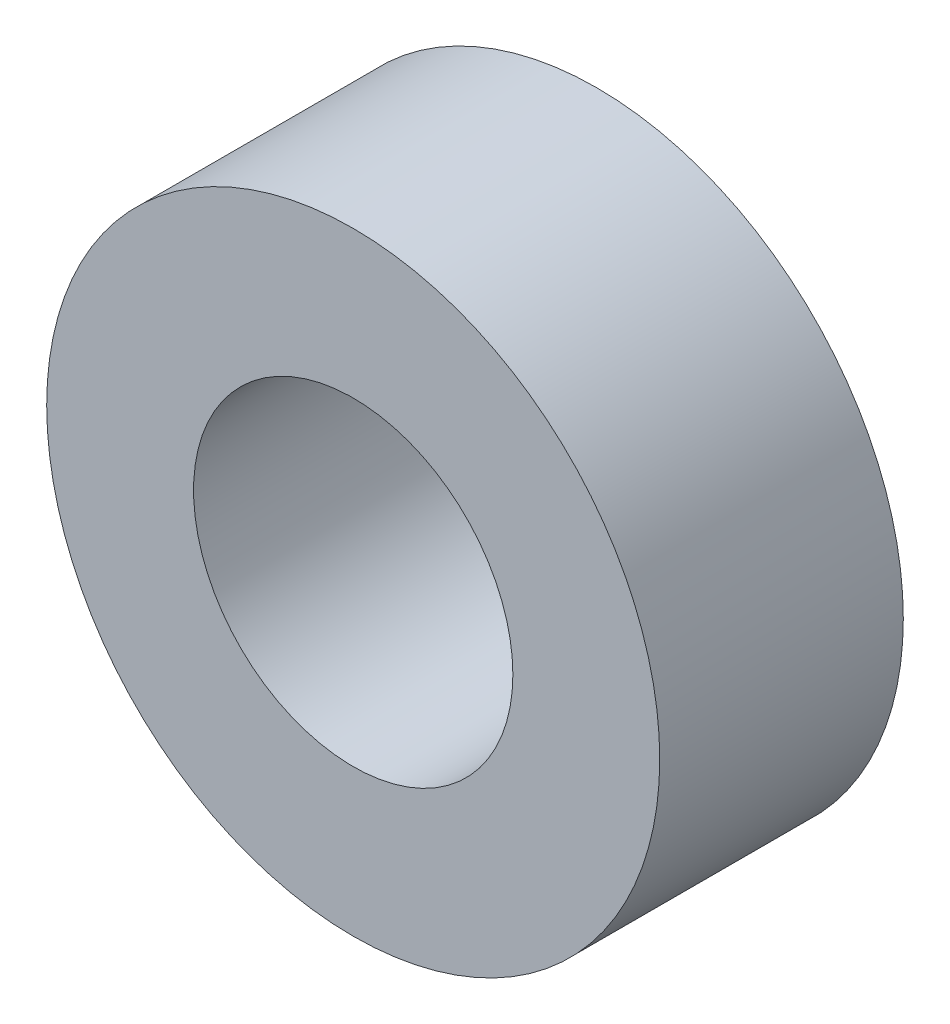
ISO-10303-21;
HEADER;
FILE_DESCRIPTION(('STEP AP214'),'2;1');
FILE_NAME('part.step','',(''),(''),'','','');
FILE_SCHEMA(('AUTOMOTIVE_DESIGN { 1 0 10303 214 1 1 1 1 }'));
ENDSEC;
DATA;
#1=APPLICATION_CONTEXT('core data for automotive mechanical design processes');
#2=APPLICATION_PROTOCOL_DEFINITION('international standard','automotive_design',2000,#1);
#3=PRODUCT_CONTEXT('',#1,'mechanical');
#4=PRODUCT('Part','Part','',(#3));
#5=PRODUCT_RELATED_PRODUCT_CATEGORY('part','',(#4));
#6=PRODUCT_DEFINITION_FORMATION('','',#4);
#7=PRODUCT_DEFINITION_CONTEXT('part definition',#1,'design');
#8=PRODUCT_DEFINITION('design','',#6,#7);
#9=PRODUCT_DEFINITION_SHAPE('','',#8);
#10=(LENGTH_UNIT() NAMED_UNIT(*) SI_UNIT(.MILLI.,.METRE.));
#11=(NAMED_UNIT(*) PLANE_ANGLE_UNIT() SI_UNIT($,.RADIAN.));
#12=(NAMED_UNIT(*) SI_UNIT($,.STERADIAN.) SOLID_ANGLE_UNIT());
#13=UNCERTAINTY_MEASURE_WITH_UNIT(LENGTH_MEASURE(1.E-05),#10,'distance_accuracy_value','');
#14=(GEOMETRIC_REPRESENTATION_CONTEXT(3) GLOBAL_UNCERTAINTY_ASSIGNED_CONTEXT((#13)) GLOBAL_UNIT_ASSIGNED_CONTEXT((#10,
#11,#12)) REPRESENTATION_CONTEXT('',''));
#15=CARTESIAN_POINT('',(0.,0.,0.));
#16=DIRECTION('',(0.,0.,1.));
#17=DIRECTION('',(1.,0.,0.));
#18=AXIS2_PLACEMENT_3D('',#15,#16,#17);
#19=CARTESIAN_POINT('',(0.,0.,1.907));
#20=DIRECTION('',(0.,0.,1.));
#21=DIRECTION('',(1.,0.,0.));
#22=AXIS2_PLACEMENT_3D('',#19,#20,#21);
#23=PLANE('',#22);
#24=CARTESIAN_POINT('',(0.,0.,1.907));
#25=DIRECTION('',(0.,0.,1.));
#26=DIRECTION('',(1.,0.,0.));
#27=AXIS2_PLACEMENT_3D('',#24,#25,#26);
#28=CIRCLE('',#27,2.4);
#29=CARTESIAN_POINT('',(2.4,0.,1.907));
#30=VERTEX_POINT('',#29);
#31=EDGE_CURVE('E10',#30,#30,#28,.T.);
#32=ORIENTED_EDGE('',*,*,#31,.T.);
#33=EDGE_LOOP('',(#32));
#34=FACE_BOUND('',#33,.T.);
#35=CARTESIAN_POINT('',(0.,0.,1.907));
#36=DIRECTION('',(0.,0.,1.));
#37=DIRECTION('',(1.,0.,0.));
#38=AXIS2_PLACEMENT_3D('',#35,#36,#37);
#39=CIRCLE('',#38,1.25);
#40=CARTESIAN_POINT('',(1.25,0.,1.907));
#41=VERTEX_POINT('',#40);
#42=EDGE_CURVE('E50',#41,#41,#39,.T.);
#43=ORIENTED_EDGE('',*,*,#42,.F.);
#44=EDGE_LOOP('',(#43));
#45=FACE_BOUND('',#44,.T.);
#46=ADVANCED_FACE('F37',(#34,#45),#23,.T.);
#47=CARTESIAN_POINT('',(0.,0.,0.));
#48=DIRECTION('',(0.,0.,1.));
#49=DIRECTION('',(1.,0.,0.));
#50=AXIS2_PLACEMENT_3D('',#47,#48,#49);
#51=PLANE('',#50);
#52=CARTESIAN_POINT('',(0.,0.,0.));
#53=DIRECTION('',(0.,0.,1.));
#54=DIRECTION('',(1.,0.,0.));
#55=AXIS2_PLACEMENT_3D('',#52,#53,#54);
#56=CIRCLE('',#55,2.4);
#57=CARTESIAN_POINT('',(2.4,0.,0.));
#58=VERTEX_POINT('',#57);
#59=EDGE_CURVE('E41',#58,#58,#56,.T.);
#60=ORIENTED_EDGE('',*,*,#59,.F.);
#61=EDGE_LOOP('',(#60));
#62=FACE_BOUND('',#61,.T.);
#63=CARTESIAN_POINT('',(0.,0.,0.));
#64=DIRECTION('',(0.,0.,1.));
#65=DIRECTION('',(1.,0.,0.));
#66=AXIS2_PLACEMENT_3D('',#63,#64,#65);
#67=CIRCLE('',#66,1.25);
#68=CARTESIAN_POINT('',(1.25,0.,0.));
#69=VERTEX_POINT('',#68);
#70=EDGE_CURVE('E52',#69,#69,#67,.T.);
#71=ORIENTED_EDGE('',*,*,#70,.T.);
#72=EDGE_LOOP('',(#71));
#73=FACE_BOUND('',#72,.T.);
#74=ADVANCED_FACE('F64',(#62,#73),#51,.F.);
#75=CARTESIAN_POINT('',(0.,0.,1.907));
#76=DIRECTION('',(0.,0.,-1.));
#77=DIRECTION('',(-1.,0.,0.));
#78=AXIS2_PLACEMENT_3D('',#75,#76,#77);
#79=CYLINDRICAL_SURFACE('',#78,2.4);
#80=ORIENTED_EDGE('',*,*,#31,.F.);
#81=EDGE_LOOP('',(#80));
#82=FACE_BOUND('',#81,.T.);
#83=ORIENTED_EDGE('',*,*,#59,.T.);
#84=EDGE_LOOP('',(#83));
#85=FACE_BOUND('',#84,.T.);
#86=ADVANCED_FACE('F39',(#82,#85),#79,.T.);
#87=CARTESIAN_POINT('',(0.,0.,1.907));
#88=DIRECTION('',(0.,0.,-1.));
#89=DIRECTION('',(-1.,0.,0.));
#90=AXIS2_PLACEMENT_3D('',#87,#88,#89);
#91=CYLINDRICAL_SURFACE('',#90,1.25);
#92=ORIENTED_EDGE('',*,*,#42,.T.);
#93=EDGE_LOOP('',(#92));
#94=FACE_BOUND('',#93,.T.);
#95=ORIENTED_EDGE('',*,*,#70,.F.);
#96=EDGE_LOOP('',(#95));
#97=FACE_BOUND('',#96,.T.);
#98=ADVANCED_FACE('F60',(#94,#97),#91,.F.);
#99=CLOSED_SHELL('',(#46,#74,#86,#98));
#100=MANIFOLD_SOLID_BREP('B2',#99);
#101=ADVANCED_BREP_SHAPE_REPRESENTATION('',(#18,#100),#14);
#102=SHAPE_DEFINITION_REPRESENTATION(#9,#101);
ENDSEC;
END-ISO-10303-21;
